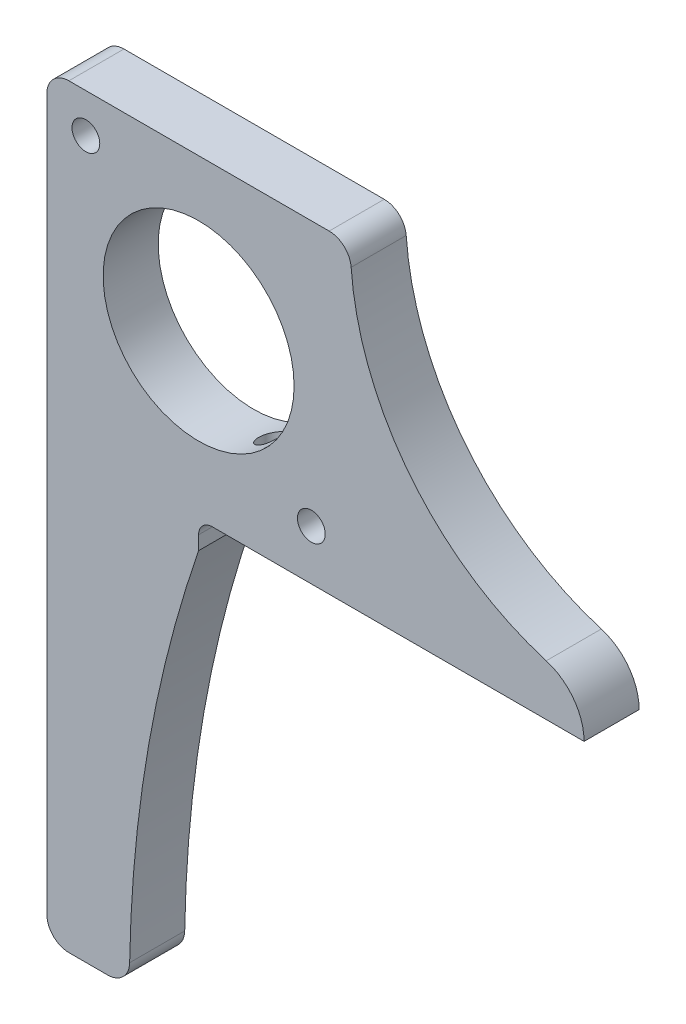
ISO-10303-21;
HEADER;
FILE_DESCRIPTION(('STEP AP214'),'2;1');
FILE_NAME('part.step','',(''),(''),'','','');
FILE_SCHEMA(('AUTOMOTIVE_DESIGN { 1 0 10303 214 1 1 1 1 }'));
ENDSEC;
DATA;
#1=APPLICATION_CONTEXT('core data for automotive mechanical design processes');
#2=APPLICATION_PROTOCOL_DEFINITION('international standard','automotive_design',2000,#1);
#3=PRODUCT_CONTEXT('',#1,'mechanical');
#4=PRODUCT('Part','Part','',(#3));
#5=PRODUCT_RELATED_PRODUCT_CATEGORY('part','',(#4));
#6=PRODUCT_DEFINITION_FORMATION('','',#4);
#7=PRODUCT_DEFINITION_CONTEXT('part definition',#1,'design');
#8=PRODUCT_DEFINITION('design','',#6,#7);
#9=PRODUCT_DEFINITION_SHAPE('','',#8);
#10=(LENGTH_UNIT() NAMED_UNIT(*) SI_UNIT(.MILLI.,.METRE.));
#11=(NAMED_UNIT(*) PLANE_ANGLE_UNIT() SI_UNIT($,.RADIAN.));
#12=(NAMED_UNIT(*) SI_UNIT($,.STERADIAN.) SOLID_ANGLE_UNIT());
#13=UNCERTAINTY_MEASURE_WITH_UNIT(LENGTH_MEASURE(1.E-05),#10,'distance_accuracy_value','');
#14=(GEOMETRIC_REPRESENTATION_CONTEXT(3) GLOBAL_UNCERTAINTY_ASSIGNED_CONTEXT((#13)) GLOBAL_UNIT_ASSIGNED_CONTEXT((#10,
#11,#12)) REPRESENTATION_CONTEXT('',''));
#15=CARTESIAN_POINT('',(0.,0.,0.));
#16=DIRECTION('',(0.,0.,1.));
#17=DIRECTION('',(1.,0.,0.));
#18=AXIS2_PLACEMENT_3D('',#15,#16,#17);
#19=CARTESIAN_POINT('',(66.75,0.,6.35));
#20=DIRECTION('',(0.,0.,1.));
#21=DIRECTION('',(1.,0.,0.));
#22=AXIS2_PLACEMENT_3D('',#19,#20,#21);
#23=PLANE('',#22);
#24=CARTESIAN_POINT('',(30.5,-30.5,6.35));
#25=DIRECTION('',(0.,0.,1.));
#26=DIRECTION('',(1.,0.,0.));
#27=AXIS2_PLACEMENT_3D('',#24,#25,#26);
#28=CIRCLE('',#27,1.6002);
#29=CARTESIAN_POINT('',(32.1002,-30.5,6.35));
#30=VERTEX_POINT('',#29);
#31=EDGE_CURVE('E381',#30,#30,#28,.T.);
#32=ORIENTED_EDGE('',*,*,#31,.F.);
#33=EDGE_LOOP('',(#32));
#34=FACE_BOUND('',#33,.T.);
#35=DIRECTION('',(1.,0.,0.));
#36=VECTOR('',#35,1.);
#37=CARTESIAN_POINT('',(9.525,-87.070000104,6.35));
#38=LINE('',#37,#36);
#39=CARTESIAN_POINT('',(2.54,-87.070000104,6.35));
#40=VERTEX_POINT('',#39);
#41=CARTESIAN_POINT('',(7.00669044993515,-87.070000104,6.35));
#42=VERTEX_POINT('',#41);
#43=EDGE_CURVE('E311',#40,#42,#38,.T.);
#44=ORIENTED_EDGE('',*,*,#43,.T.);
#45=CARTESIAN_POINT('',(7.00669044993515,-84.530000104,6.35));
#46=DIRECTION('',(0.,0.,1.));
#47=DIRECTION('',(1.,0.,0.));
#48=AXIS2_PLACEMENT_3D('',#45,#46,#47);
#49=CIRCLE('',#48,2.54);
#50=CARTESIAN_POINT('',(9.54632002370526,-84.573377840598,6.35));
#51=VERTEX_POINT('',#50);
#52=EDGE_CURVE('E270',#42,#51,#49,.T.);
#53=ORIENTED_EDGE('',*,*,#52,.T.);
#54=CARTESIAN_POINT('',(155.715673981192,-87.070000104,6.35));
#55=DIRECTION('',(0.,0.,-1.));
#56=DIRECTION('',(-1.,0.,0.));
#57=AXIS2_PLACEMENT_3D('',#54,#55,#56);
#58=CIRCLE('',#57,146.190673981192);
#59=CARTESIAN_POINT('',(17.5,-39.445000104,6.35));
#60=VERTEX_POINT('',#59);
#61=EDGE_CURVE('E345',#51,#60,#58,.T.);
#62=ORIENTED_EDGE('',*,*,#61,.T.);
#63=DIRECTION('',(0.,1.,0.));
#64=VECTOR('',#63,1.);
#65=CARTESIAN_POINT('',(17.5,-36.270000104,6.35));
#66=LINE('',#65,#64);
#67=CARTESIAN_POINT('',(17.5,-37.857500104,6.35));
#68=VERTEX_POINT('',#67);
#69=EDGE_CURVE('E366',#60,#68,#66,.T.);
#70=ORIENTED_EDGE('',*,*,#69,.T.);
#71=CARTESIAN_POINT('',(19.0875,-37.857500104,6.35));
#72=DIRECTION('',(0.,0.,1.));
#73=DIRECTION('',(1.,0.,0.));
#74=AXIS2_PLACEMENT_3D('',#71,#72,#73);
#75=CIRCLE('',#74,1.5875);
#76=CARTESIAN_POINT('',(19.0875,-36.270000104,6.35));
#77=VERTEX_POINT('',#76);
#78=EDGE_CURVE('E11',#68,#77,#75,.F.);
#79=ORIENTED_EDGE('',*,*,#78,.T.);
#80=DIRECTION('',(1.,0.,0.));
#81=VECTOR('',#80,1.);
#82=CARTESIAN_POINT('',(17.5,-36.270000104,6.35));
#83=LINE('',#82,#81);
#84=CARTESIAN_POINT('',(61.95,-36.270000104,6.35));
#85=VERTEX_POINT('',#84);
#86=EDGE_CURVE('E363',#77,#85,#83,.T.);
#87=ORIENTED_EDGE('',*,*,#86,.T.);
#88=CARTESIAN_POINT('',(55.8184525502011,-36.270000104,6.35));
#89=DIRECTION('',(0.,0.,1.));
#90=DIRECTION('',(1.,0.,0.));
#91=AXIS2_PLACEMENT_3D('',#88,#89,#90);
#92=CIRCLE('',#91,6.13154744979888);
#93=CARTESIAN_POINT('',(57.5878444151188,-30.3992994169015,6.35));
#94=VERTEX_POINT('',#93);
#95=EDGE_CURVE('E296',#85,#94,#92,.T.);
#96=ORIENTED_EDGE('',*,*,#95,.T.);
#97=CARTESIAN_POINT('',(66.75,0.,6.35));
#98=DIRECTION('',(0.,0.,-1.));
#99=DIRECTION('',(1.,0.,0.));
#100=AXIS2_PLACEMENT_3D('',#97,#98,#99);
#101=CIRCLE('',#100,31.75);
#102=CARTESIAN_POINT('',(35.0872254395332,-2.35185185185185,6.35));
#103=VERTEX_POINT('',#102);
#104=EDGE_CURVE('E288',#94,#103,#101,.T.);
#105=ORIENTED_EDGE('',*,*,#104,.T.);
#106=CARTESIAN_POINT('',(32.5542034746959,-2.54,6.35));
#107=DIRECTION('',(0.,0.,1.));
#108=DIRECTION('',(1.,0.,0.));
#109=AXIS2_PLACEMENT_3D('',#106,#107,#108);
#110=CIRCLE('',#109,2.54);
#111=CARTESIAN_POINT('',(32.5542034746959,0.,6.35));
#112=VERTEX_POINT('',#111);
#113=EDGE_CURVE('E268',#103,#112,#110,.T.);
#114=ORIENTED_EDGE('',*,*,#113,.T.);
#115=DIRECTION('',(-1.,0.,0.));
#116=VECTOR('',#115,1.);
#117=CARTESIAN_POINT('',(0.,0.,6.35));
#118=LINE('',#117,#116);
#119=CARTESIAN_POINT('',(2.54,0.,6.35));
#120=VERTEX_POINT('',#119);
#121=EDGE_CURVE('E298',#112,#120,#118,.T.);
#122=ORIENTED_EDGE('',*,*,#121,.T.);
#123=CARTESIAN_POINT('',(2.54,-2.54,6.35));
#124=DIRECTION('',(0.,0.,1.));
#125=DIRECTION('',(1.,0.,0.));
#126=AXIS2_PLACEMENT_3D('',#123,#124,#125);
#127=CIRCLE('',#126,2.54);
#128=CARTESIAN_POINT('',(0.,-2.54,6.35));
#129=VERTEX_POINT('',#128);
#130=EDGE_CURVE('E260',#120,#129,#127,.T.);
#131=ORIENTED_EDGE('',*,*,#130,.T.);
#132=DIRECTION('',(0.,-1.,0.));
#133=VECTOR('',#132,1.);
#134=CARTESIAN_POINT('',(0.,-36.270000104,6.35));
#135=LINE('',#134,#133);
#136=CARTESIAN_POINT('',(0.,-84.530000104,6.35));
#137=VERTEX_POINT('',#136);
#138=EDGE_CURVE('E309',#129,#137,#135,.T.);
#139=ORIENTED_EDGE('',*,*,#138,.T.);
#140=CARTESIAN_POINT('',(2.54,-84.530000104,6.35));
#141=DIRECTION('',(0.,0.,1.));
#142=DIRECTION('',(1.,0.,0.));
#143=AXIS2_PLACEMENT_3D('',#140,#141,#142);
#144=CIRCLE('',#143,2.54);
#145=EDGE_CURVE('E267',#137,#40,#144,.T.);
#146=ORIENTED_EDGE('',*,*,#145,.T.);
#147=EDGE_LOOP('',(#44,#53,#62,#70,#79,#87,#96,#105,#114,#122,#131,#139,#146));
#148=FACE_BOUND('',#147,.T.);
#149=CARTESIAN_POINT('',(4.5,-4.5,6.35));
#150=DIRECTION('',(0.,0.,1.));
#151=DIRECTION('',(1.,0.,0.));
#152=AXIS2_PLACEMENT_3D('',#149,#150,#151);
#153=CIRCLE('',#152,1.6002);
#154=CARTESIAN_POINT('',(6.1002,-4.5,6.35));
#155=VERTEX_POINT('',#154);
#156=EDGE_CURVE('E373',#155,#155,#153,.T.);
#157=ORIENTED_EDGE('',*,*,#156,.F.);
#158=EDGE_LOOP('',(#157));
#159=FACE_BOUND('',#158,.T.);
#160=CARTESIAN_POINT('',(17.5,-17.5,6.35));
#161=DIRECTION('',(0.,0.,1.));
#162=DIRECTION('',(1.,0.,0.));
#163=AXIS2_PLACEMENT_3D('',#160,#161,#162);
#164=CIRCLE('',#163,11.0109);
#165=CARTESIAN_POINT('',(28.5109,-17.5,6.35));
#166=VERTEX_POINT('',#165);
#167=EDGE_CURVE('E387',#166,#166,#164,.T.);
#168=ORIENTED_EDGE('',*,*,#167,.F.);
#169=EDGE_LOOP('',(#168));
#170=FACE_BOUND('',#169,.T.);
#171=ADVANCED_FACE('F43',(#34,#148,#159,#170),#23,.T.);
#172=CARTESIAN_POINT('',(66.75,0.,0.));
#173=DIRECTION('',(0.,0.,1.));
#174=DIRECTION('',(1.,0.,0.));
#175=AXIS2_PLACEMENT_3D('',#172,#173,#174);
#176=PLANE('',#175);
#177=CARTESIAN_POINT('',(30.5,-30.5,0.));
#178=DIRECTION('',(0.,0.,1.));
#179=DIRECTION('',(1.,0.,0.));
#180=AXIS2_PLACEMENT_3D('',#177,#178,#179);
#181=CIRCLE('',#180,1.6002);
#182=CARTESIAN_POINT('',(32.1002,-30.5,0.));
#183=VERTEX_POINT('',#182);
#184=EDGE_CURVE('E384',#183,#183,#181,.T.);
#185=ORIENTED_EDGE('',*,*,#184,.T.);
#186=EDGE_LOOP('',(#185));
#187=FACE_BOUND('',#186,.T.);
#188=CARTESIAN_POINT('',(155.715673981192,-87.070000104,0.));
#189=DIRECTION('',(0.,0.,-1.));
#190=DIRECTION('',(-1.,0.,0.));
#191=AXIS2_PLACEMENT_3D('',#188,#189,#190);
#192=CIRCLE('',#191,146.190673981192);
#193=CARTESIAN_POINT('',(9.54632002370526,-84.573377840598,0.));
#194=VERTEX_POINT('',#193);
#195=CARTESIAN_POINT('',(17.5,-39.445000104,0.));
#196=VERTEX_POINT('',#195);
#197=EDGE_CURVE('E349',#194,#196,#192,.T.);
#198=ORIENTED_EDGE('',*,*,#197,.F.);
#199=CARTESIAN_POINT('',(7.00669044993515,-84.530000104,0.));
#200=DIRECTION('',(0.,0.,1.));
#201=DIRECTION('',(1.,0.,0.));
#202=AXIS2_PLACEMENT_3D('',#199,#200,#201);
#203=CIRCLE('',#202,2.54);
#204=CARTESIAN_POINT('',(7.00669044993515,-87.070000104,0.));
#205=VERTEX_POINT('',#204);
#206=EDGE_CURVE('E332',#194,#205,#203,.F.);
#207=ORIENTED_EDGE('',*,*,#206,.T.);
#208=DIRECTION('',(1.,0.,0.));
#209=VECTOR('',#208,1.);
#210=CARTESIAN_POINT('',(9.525,-87.070000104,0.));
#211=LINE('',#210,#209);
#212=CARTESIAN_POINT('',(2.54,-87.070000104,0.));
#213=VERTEX_POINT('',#212);
#214=EDGE_CURVE('E341',#213,#205,#211,.T.);
#215=ORIENTED_EDGE('',*,*,#214,.F.);
#216=CARTESIAN_POINT('',(2.54,-84.530000104,0.));
#217=DIRECTION('',(0.,0.,1.));
#218=DIRECTION('',(1.,0.,0.));
#219=AXIS2_PLACEMENT_3D('',#216,#217,#218);
#220=CIRCLE('',#219,2.54);
#221=CARTESIAN_POINT('',(0.,-84.530000104,0.));
#222=VERTEX_POINT('',#221);
#223=EDGE_CURVE('E330',#213,#222,#220,.F.);
#224=ORIENTED_EDGE('',*,*,#223,.T.);
#225=DIRECTION('',(0.,-1.,0.));
#226=VECTOR('',#225,1.);
#227=CARTESIAN_POINT('',(0.,-87.070000104,0.));
#228=LINE('',#227,#226);
#229=CARTESIAN_POINT('',(0.,-2.54,0.));
#230=VERTEX_POINT('',#229);
#231=EDGE_CURVE('E354',#230,#222,#228,.T.);
#232=ORIENTED_EDGE('',*,*,#231,.F.);
#233=CARTESIAN_POINT('',(2.54,-2.54,0.));
#234=DIRECTION('',(0.,0.,1.));
#235=DIRECTION('',(1.,0.,0.));
#236=AXIS2_PLACEMENT_3D('',#233,#234,#235);
#237=CIRCLE('',#236,2.54);
#238=CARTESIAN_POINT('',(2.54,0.,0.));
#239=VERTEX_POINT('',#238);
#240=EDGE_CURVE('E308',#230,#239,#237,.F.);
#241=ORIENTED_EDGE('',*,*,#240,.T.);
#242=DIRECTION('',(-1.,0.,0.));
#243=VECTOR('',#242,1.);
#244=CARTESIAN_POINT('',(0.,0.,0.));
#245=LINE('',#244,#243);
#246=CARTESIAN_POINT('',(32.5542034746959,0.,0.));
#247=VERTEX_POINT('',#246);
#248=EDGE_CURVE('E304',#247,#239,#245,.T.);
#249=ORIENTED_EDGE('',*,*,#248,.F.);
#250=CARTESIAN_POINT('',(32.5542034746959,-2.54,0.));
#251=DIRECTION('',(0.,0.,1.));
#252=DIRECTION('',(1.,0.,0.));
#253=AXIS2_PLACEMENT_3D('',#250,#251,#252);
#254=CIRCLE('',#253,2.54);
#255=CARTESIAN_POINT('',(35.0872254395332,-2.35185185185185,0.));
#256=VERTEX_POINT('',#255);
#257=EDGE_CURVE('E301',#247,#256,#254,.F.);
#258=ORIENTED_EDGE('',*,*,#257,.T.);
#259=CARTESIAN_POINT('',(66.75,0.,0.));
#260=DIRECTION('',(0.,0.,-1.));
#261=DIRECTION('',(1.,0.,0.));
#262=AXIS2_PLACEMENT_3D('',#259,#260,#261);
#263=CIRCLE('',#262,31.75);
#264=CARTESIAN_POINT('',(57.5878444151188,-30.3992994169015,0.));
#265=VERTEX_POINT('',#264);
#266=EDGE_CURVE('E290',#265,#256,#263,.T.);
#267=ORIENTED_EDGE('',*,*,#266,.F.);
#268=CARTESIAN_POINT('',(55.8184525502011,-36.270000104,0.));
#269=DIRECTION('',(0.,0.,1.));
#270=DIRECTION('',(1.,0.,0.));
#271=AXIS2_PLACEMENT_3D('',#268,#269,#270);
#272=CIRCLE('',#271,6.13154744979888);
#273=CARTESIAN_POINT('',(61.95,-36.270000104,0.));
#274=VERTEX_POINT('',#273);
#275=EDGE_CURVE('E313',#274,#265,#272,.T.);
#276=ORIENTED_EDGE('',*,*,#275,.F.);
#277=DIRECTION('',(1.,0.,0.));
#278=VECTOR('',#277,1.);
#279=CARTESIAN_POINT('',(17.5,-36.270000104,0.));
#280=LINE('',#279,#278);
#281=CARTESIAN_POINT('',(19.0875,-36.270000104,0.));
#282=VERTEX_POINT('',#281);
#283=EDGE_CURVE('E352',#282,#274,#280,.T.);
#284=ORIENTED_EDGE('',*,*,#283,.F.);
#285=CARTESIAN_POINT('',(19.0875,-37.857500104,0.));
#286=DIRECTION('',(0.,0.,1.));
#287=DIRECTION('',(1.,0.,0.));
#288=AXIS2_PLACEMENT_3D('',#285,#286,#287);
#289=CIRCLE('',#288,1.5875);
#290=CARTESIAN_POINT('',(17.5,-37.857500104,0.));
#291=VERTEX_POINT('',#290);
#292=EDGE_CURVE('E51',#282,#291,#289,.T.);
#293=ORIENTED_EDGE('',*,*,#292,.T.);
#294=DIRECTION('',(0.,1.,0.));
#295=VECTOR('',#294,1.);
#296=CARTESIAN_POINT('',(17.5,-36.270000104,0.));
#297=LINE('',#296,#295);
#298=EDGE_CURVE('E350',#196,#291,#297,.T.);
#299=ORIENTED_EDGE('',*,*,#298,.F.);
#300=EDGE_LOOP('',(#198,#207,#215,#224,#232,#241,#249,#258,#267,#276,#284,#293,#299));
#301=FACE_BOUND('',#300,.T.);
#302=CARTESIAN_POINT('',(4.5,-4.5,0.));
#303=DIRECTION('',(0.,0.,1.));
#304=DIRECTION('',(1.,0.,0.));
#305=AXIS2_PLACEMENT_3D('',#302,#303,#304);
#306=CIRCLE('',#305,1.6002);
#307=CARTESIAN_POINT('',(6.1002,-4.5,0.));
#308=VERTEX_POINT('',#307);
#309=EDGE_CURVE('E376',#308,#308,#306,.T.);
#310=ORIENTED_EDGE('',*,*,#309,.T.);
#311=EDGE_LOOP('',(#310));
#312=FACE_BOUND('',#311,.T.);
#313=CARTESIAN_POINT('',(17.5,-17.5,0.));
#314=DIRECTION('',(0.,0.,1.));
#315=DIRECTION('',(1.,0.,0.));
#316=AXIS2_PLACEMENT_3D('',#313,#314,#315);
#317=CIRCLE('',#316,11.0109);
#318=CARTESIAN_POINT('',(28.5109,-17.5,0.));
#319=VERTEX_POINT('',#318);
#320=EDGE_CURVE('E390',#319,#319,#317,.T.);
#321=ORIENTED_EDGE('',*,*,#320,.T.);
#322=EDGE_LOOP('',(#321));
#323=FACE_BOUND('',#322,.T.);
#324=ADVANCED_FACE('F203',(#187,#301,#312,#323),#176,.F.);
#325=CARTESIAN_POINT('',(0.,-87.070000104,6.35));
#326=DIRECTION('',(1.,0.,0.));
#327=DIRECTION('',(0.,0.,-1.));
#328=AXIS2_PLACEMENT_3D('',#325,#326,#327);
#329=PLANE('',#328);
#330=ORIENTED_EDGE('',*,*,#231,.T.);
#331=DIRECTION('',(0.,0.,-1.));
#332=VECTOR('',#331,1.);
#333=CARTESIAN_POINT('',(0.,-84.530000104,6.35));
#334=LINE('',#333,#332);
#335=EDGE_CURVE('E278',#222,#137,#334,.F.);
#336=ORIENTED_EDGE('',*,*,#335,.T.);
#337=ORIENTED_EDGE('',*,*,#138,.F.);
#338=DIRECTION('',(0.,0.,-1.));
#339=VECTOR('',#338,1.);
#340=CARTESIAN_POINT('',(0.,-2.54,6.35));
#341=LINE('',#340,#339);
#342=EDGE_CURVE('E263',#129,#230,#341,.T.);
#343=ORIENTED_EDGE('',*,*,#342,.T.);
#344=EDGE_LOOP('',(#330,#336,#337,#343));
#345=FACE_BOUND('',#344,.T.);
#346=ADVANCED_FACE('F208',(#345),#329,.F.);
#347=CARTESIAN_POINT('',(9.525,-87.070000104,6.35));
#348=DIRECTION('',(0.,1.,0.));
#349=DIRECTION('',(0.,0.,1.));
#350=AXIS2_PLACEMENT_3D('',#347,#348,#349);
#351=PLANE('',#350);
#352=ORIENTED_EDGE('',*,*,#214,.T.);
#353=DIRECTION('',(0.,0.,-1.));
#354=VECTOR('',#353,1.);
#355=CARTESIAN_POINT('',(7.00669044993515,-87.070000104,6.35));
#356=LINE('',#355,#354);
#357=EDGE_CURVE('E272',#205,#42,#356,.F.);
#358=ORIENTED_EDGE('',*,*,#357,.T.);
#359=ORIENTED_EDGE('',*,*,#43,.F.);
#360=DIRECTION('',(0.,0.,-1.));
#361=VECTOR('',#360,1.);
#362=CARTESIAN_POINT('',(2.54,-87.070000104,6.35));
#363=LINE('',#362,#361);
#364=EDGE_CURVE('E334',#40,#213,#363,.T.);
#365=ORIENTED_EDGE('',*,*,#364,.T.);
#366=EDGE_LOOP('',(#352,#358,#359,#365));
#367=FACE_BOUND('',#366,.T.);
#368=ADVANCED_FACE('F238',(#367),#351,.F.);
#369=CARTESIAN_POINT('',(155.715673981192,-87.070000104,6.35));
#370=DIRECTION('',(0.,0.,-1.));
#371=DIRECTION('',(-1.,0.,0.));
#372=AXIS2_PLACEMENT_3D('',#369,#370,#371);
#373=CYLINDRICAL_SURFACE('',#372,146.190673981192);
#374=ORIENTED_EDGE('',*,*,#61,.F.);
#375=DIRECTION('',(0.,0.,-1.));
#376=VECTOR('',#375,1.);
#377=CARTESIAN_POINT('',(9.5463200237052,-84.573377840598,6.35));
#378=LINE('',#377,#376);
#379=EDGE_CURVE('E325',#51,#194,#378,.T.);
#380=ORIENTED_EDGE('',*,*,#379,.T.);
#381=ORIENTED_EDGE('',*,*,#197,.T.);
#382=DIRECTION('',(0.,0.,-1.));
#383=VECTOR('',#382,1.);
#384=CARTESIAN_POINT('',(17.5,-39.445000104,6.35));
#385=LINE('',#384,#383);
#386=EDGE_CURVE('E322',#60,#196,#385,.T.);
#387=ORIENTED_EDGE('',*,*,#386,.F.);
#388=EDGE_LOOP('',(#374,#380,#381,#387));
#389=FACE_BOUND('',#388,.T.);
#390=ADVANCED_FACE('F235',(#389),#373,.F.);
#391=CARTESIAN_POINT('',(17.5,-36.270000104,6.35));
#392=DIRECTION('',(-1.,0.,0.));
#393=DIRECTION('',(0.,0.,1.));
#394=AXIS2_PLACEMENT_3D('',#391,#392,#393);
#395=PLANE('',#394);
#396=ORIENTED_EDGE('',*,*,#298,.T.);
#397=DIRECTION('',(0.,0.,-1.));
#398=VECTOR('',#397,1.);
#399=CARTESIAN_POINT('',(17.5,-37.857500104,6.35));
#400=LINE('',#399,#398);
#401=EDGE_CURVE('E58',#291,#68,#400,.F.);
#402=ORIENTED_EDGE('',*,*,#401,.T.);
#403=ORIENTED_EDGE('',*,*,#69,.F.);
#404=ORIENTED_EDGE('',*,*,#386,.T.);
#405=EDGE_LOOP('',(#396,#402,#403,#404));
#406=FACE_BOUND('',#405,.T.);
#407=ADVANCED_FACE('F231',(#406),#395,.F.);
#408=CARTESIAN_POINT('',(17.5,-36.270000104,6.35));
#409=DIRECTION('',(0.,1.,0.));
#410=DIRECTION('',(0.,0.,1.));
#411=AXIS2_PLACEMENT_3D('',#408,#409,#410);
#412=PLANE('',#411);
#413=CARTESIAN_POINT('',(22.58,-36.270000104,3.175));
#414=DIRECTION('',(0.,-1.,0.));
#415=DIRECTION('',(0.,0.,-1.));
#416=AXIS2_PLACEMENT_3D('',#413,#414,#415);
#417=CIRCLE('',#416,1.35255);
#418=CARTESIAN_POINT('',(22.58,-36.270000104,1.82245));
#419=VERTEX_POINT('',#418);
#420=EDGE_CURVE('E160',#419,#419,#417,.T.);
#421=ORIENTED_EDGE('',*,*,#420,.F.);
#422=EDGE_LOOP('',(#421));
#423=FACE_BOUND('',#422,.T.);
#424=CARTESIAN_POINT('',(47.98,-36.270000104,3.175));
#425=DIRECTION('',(0.,-1.,0.));
#426=DIRECTION('',(0.,0.,-1.));
#427=AXIS2_PLACEMENT_3D('',#424,#425,#426);
#428=CIRCLE('',#427,1.35255);
#429=CARTESIAN_POINT('',(47.98,-36.270000104,1.82245));
#430=VERTEX_POINT('',#429);
#431=EDGE_CURVE('E159',#430,#430,#428,.T.);
#432=ORIENTED_EDGE('',*,*,#431,.F.);
#433=EDGE_LOOP('',(#432));
#434=FACE_BOUND('',#433,.T.);
#435=ORIENTED_EDGE('',*,*,#86,.F.);
#436=DIRECTION('',(0.,0.,-1.));
#437=VECTOR('',#436,1.);
#438=CARTESIAN_POINT('',(19.0875,-36.270000104,0.));
#439=LINE('',#438,#437);
#440=EDGE_CURVE('E164',#77,#282,#439,.T.);
#441=ORIENTED_EDGE('',*,*,#440,.T.);
#442=ORIENTED_EDGE('',*,*,#283,.T.);
#443=DIRECTION('',(0.,0.,-1.));
#444=VECTOR('',#443,1.);
#445=CARTESIAN_POINT('',(61.95,-36.270000104,6.35));
#446=LINE('',#445,#444);
#447=EDGE_CURVE('E319',#85,#274,#446,.T.);
#448=ORIENTED_EDGE('',*,*,#447,.F.);
#449=EDGE_LOOP('',(#435,#441,#442,#448));
#450=FACE_BOUND('',#449,.T.);
#451=ADVANCED_FACE('F227',(#423,#434,#450),#412,.F.);
#452=CARTESIAN_POINT('',(55.8184525502011,-36.270000104,6.35));
#453=DIRECTION('',(0.,0.,-1.));
#454=DIRECTION('',(-1.,0.,0.));
#455=AXIS2_PLACEMENT_3D('',#452,#453,#454);
#456=CYLINDRICAL_SURFACE('',#455,6.13154744979888);
#457=ORIENTED_EDGE('',*,*,#275,.T.);
#458=DIRECTION('',(0.,0.,-1.));
#459=VECTOR('',#458,1.);
#460=CARTESIAN_POINT('',(57.5878444151188,-30.3992994169015,6.35));
#461=LINE('',#460,#459);
#462=EDGE_CURVE('E317',#94,#265,#461,.T.);
#463=ORIENTED_EDGE('',*,*,#462,.F.);
#464=ORIENTED_EDGE('',*,*,#95,.F.);
#465=ORIENTED_EDGE('',*,*,#447,.T.);
#466=EDGE_LOOP('',(#457,#463,#464,#465));
#467=FACE_BOUND('',#466,.T.);
#468=ADVANCED_FACE('F223',(#467),#456,.T.);
#469=CARTESIAN_POINT('',(66.75,0.,6.35));
#470=DIRECTION('',(0.,0.,-1.));
#471=DIRECTION('',(-1.,0.,0.));
#472=AXIS2_PLACEMENT_3D('',#469,#470,#471);
#473=CYLINDRICAL_SURFACE('',#472,31.75);
#474=ORIENTED_EDGE('',*,*,#266,.T.);
#475=DIRECTION('',(0.,0.,-1.));
#476=VECTOR('',#475,1.);
#477=CARTESIAN_POINT('',(35.0872254395332,-2.35185185185185,6.35));
#478=LINE('',#477,#476);
#479=EDGE_CURVE('E154',#256,#103,#478,.F.);
#480=ORIENTED_EDGE('',*,*,#479,.T.);
#481=ORIENTED_EDGE('',*,*,#104,.F.);
#482=ORIENTED_EDGE('',*,*,#462,.T.);
#483=EDGE_LOOP('',(#474,#480,#481,#482));
#484=FACE_BOUND('',#483,.T.);
#485=ADVANCED_FACE('F219',(#484),#473,.F.);
#486=CARTESIAN_POINT('',(0.,0.,6.35));
#487=DIRECTION('',(0.,-1.,0.));
#488=DIRECTION('',(0.,0.,-1.));
#489=AXIS2_PLACEMENT_3D('',#486,#487,#488);
#490=PLANE('',#489);
#491=ORIENTED_EDGE('',*,*,#248,.T.);
#492=DIRECTION('',(0.,0.,-1.));
#493=VECTOR('',#492,1.);
#494=CARTESIAN_POINT('',(2.54,0.,6.35));
#495=LINE('',#494,#493);
#496=EDGE_CURVE('E261',#239,#120,#495,.F.);
#497=ORIENTED_EDGE('',*,*,#496,.T.);
#498=ORIENTED_EDGE('',*,*,#121,.F.);
#499=DIRECTION('',(0.,0.,-1.));
#500=VECTOR('',#499,1.);
#501=CARTESIAN_POINT('',(32.5542034746959,0.,6.35));
#502=LINE('',#501,#500);
#503=EDGE_CURVE('E280',#112,#247,#502,.T.);
#504=ORIENTED_EDGE('',*,*,#503,.T.);
#505=EDGE_LOOP('',(#491,#497,#498,#504));
#506=FACE_BOUND('',#505,.T.);
#507=ADVANCED_FACE('F216',(#506),#490,.F.);
#508=CARTESIAN_POINT('',(4.5,-4.5,6.35));
#509=DIRECTION('',(0.,0.,-1.));
#510=DIRECTION('',(-1.,0.,0.));
#511=AXIS2_PLACEMENT_3D('',#508,#509,#510);
#512=CYLINDRICAL_SURFACE('',#511,1.6002);
#513=ORIENTED_EDGE('',*,*,#156,.T.);
#514=EDGE_LOOP('',(#513));
#515=FACE_BOUND('',#514,.T.);
#516=ORIENTED_EDGE('',*,*,#309,.F.);
#517=EDGE_LOOP('',(#516));
#518=FACE_BOUND('',#517,.T.);
#519=ADVANCED_FACE('F214',(#515,#518),#512,.F.);
#520=CARTESIAN_POINT('',(30.5,-30.5,6.35));
#521=DIRECTION('',(0.,0.,-1.));
#522=DIRECTION('',(-1.,0.,0.));
#523=AXIS2_PLACEMENT_3D('',#520,#521,#522);
#524=CYLINDRICAL_SURFACE('',#523,1.6002);
#525=ORIENTED_EDGE('',*,*,#31,.T.);
#526=EDGE_LOOP('',(#525));
#527=FACE_BOUND('',#526,.T.);
#528=ORIENTED_EDGE('',*,*,#184,.F.);
#529=EDGE_LOOP('',(#528));
#530=FACE_BOUND('',#529,.T.);
#531=ADVANCED_FACE('F410',(#527,#530),#524,.F.);
#532=CARTESIAN_POINT('',(17.5,-17.5,6.35));
#533=DIRECTION('',(0.,0.,-1.));
#534=DIRECTION('',(-1.,0.,0.));
#535=AXIS2_PLACEMENT_3D('',#532,#533,#534);
#536=CYLINDRICAL_SURFACE('',#535,11.0109);
#537=CARTESIAN_POINT('',(23.2632447972397,-26.882160104,2.00770909814869));
#538=CARTESIAN_POINT('',(23.2191274192163,-26.9092627305194,1.98190065627333));
#539=CARTESIAN_POINT('',(23.1737607937613,-26.9366984105925,1.95869106276661));
#540=CARTESIAN_POINT('',(23.0808740764004,-26.9919272441979,1.91757885540883));
#541=CARTESIAN_POINT('',(23.0333535034497,-27.0197204765804,1.89967743384087));
#542=CARTESIAN_POINT('',(22.8880963102266,-27.1031622289968,1.8541110158982));
#543=CARTESIAN_POINT('',(22.7876762564426,-27.1588653553026,1.83459086021908));
#544=CARTESIAN_POINT('',(22.5991203161401,-27.2595385986938,1.81979061450837));
#545=CARTESIAN_POINT('',(22.5114027069368,-27.3048648604502,1.8213122236522));
#546=CARTESIAN_POINT('',(22.3364415800379,-27.392333880953,1.84165876886262));
#547=CARTESIAN_POINT('',(22.2491975568835,-27.4344811946954,1.8604584178442));
#548=CARTESIAN_POINT('',(22.0828068769375,-27.5122827250559,1.91427245749288));
#549=CARTESIAN_POINT('',(22.0034754197801,-27.5481613547704,1.94838644078591));
#550=CARTESIAN_POINT('',(21.8512342705955,-27.6150177486546,2.03227119667013));
#551=CARTESIAN_POINT('',(21.7783218616213,-27.6459975907646,2.0820353039625));
#552=CARTESIAN_POINT('',(21.6492213853346,-27.6994254778065,2.19040894968857));
#553=CARTESIAN_POINT('',(21.5920888051906,-27.7224182316324,2.24762552161462));
#554=CARTESIAN_POINT('',(21.4882901062074,-27.7633610285751,2.37242009969434));
#555=CARTESIAN_POINT('',(21.4416174827113,-27.7813142073797,2.43999162221827));
#556=CARTESIAN_POINT('',(21.3643647403757,-27.8105853790684,2.57726146314473));
#557=CARTESIAN_POINT('',(21.3327520134929,-27.8223385097762,2.64628752910649));
#558=CARTESIAN_POINT('',(21.2814151795915,-27.8412558825341,2.78921734625611));
#559=CARTESIAN_POINT('',(21.261687295199,-27.848421582658,2.86311953936428));
#560=CARTESIAN_POINT('',(21.2356068211506,-27.8578638549165,3.00983045964442));
#561=CARTESIAN_POINT('',(21.2286525812627,-27.86036045762,3.08251872595468));
#562=CARTESIAN_POINT('',(21.2265343148407,-27.8611226842052,3.22808478156545));
#563=CARTESIAN_POINT('',(21.2313686524239,-27.8593888951319,3.30096254316808));
#564=CARTESIAN_POINT('',(21.2524632656462,-27.8517659546779,3.443615354599));
#565=CARTESIAN_POINT('',(21.2685391523779,-27.8459438552294,3.51342141342629));
#566=CARTESIAN_POINT('',(21.3113081878209,-27.8302644419951,3.64921519793276));
#567=CARTESIAN_POINT('',(21.3380012837232,-27.8204071482801,3.71520294260199));
#568=CARTESIAN_POINT('',(21.4013614909001,-27.7966231685822,3.84230772595344));
#569=CARTESIAN_POINT('',(21.4381328576693,-27.7826538267068,3.90336469883516));
#570=CARTESIAN_POINT('',(21.5201898713736,-27.7508498827576,4.0183169499585));
#571=CARTESIAN_POINT('',(21.5654765378499,-27.7330148177997,4.0722113693038));
#572=CARTESIAN_POINT('',(21.6648885932006,-27.6929678631149,4.17359512341496));
#573=CARTESIAN_POINT('',(21.7192845599078,-27.6706153517114,4.22076304616354));
#574=CARTESIAN_POINT('',(21.8337836446012,-27.6223563264631,4.30531972276142));
#575=CARTESIAN_POINT('',(21.8938882454652,-27.5964488884072,4.34270592618467));
#576=CARTESIAN_POINT('',(22.0222118662112,-27.5396593225933,4.40943921206858));
#577=CARTESIAN_POINT('',(22.0907047577537,-27.508559404209,4.43807295987646));
#578=CARTESIAN_POINT('',(22.2301400301379,-27.4434211412268,4.48357719981378));
#579=CARTESIAN_POINT('',(22.3010832152698,-27.4093818261873,4.50044379020204));
#580=CARTESIAN_POINT('',(22.4501423579769,-27.3358283652304,4.52360044676788));
#581=CARTESIAN_POINT('',(22.5283228021518,-27.2960979844918,4.52878658392732));
#582=CARTESIAN_POINT('',(22.6835258856988,-27.214868717428,4.52581648062969));
#583=CARTESIAN_POINT('',(22.7605477890849,-27.1733687662278,4.5176520926385));
#584=CARTESIAN_POINT('',(22.9112084302784,-27.0898940752176,4.48859936143994));
#585=CARTESIAN_POINT('',(22.984865831107,-27.0479241437291,4.46779367402509));
#586=CARTESIAN_POINT('',(23.1277336154652,-26.9644352148196,4.41402787032647));
#587=CARTESIAN_POINT('',(23.196949466236,-26.9229157173977,4.38108304705518));
#588=CARTESIAN_POINT('',(23.2632447972397,-26.882160104,4.34229090185131));
#589=B_SPLINE_CURVE_WITH_KNOTS('',3,(#537,#538,#539,#540,#541,#542,#543,#544,#545,#546,#547,
#548,#549,#550,#551,#552,#553,#554,#555,#556,#557,#558,#559,#560,#561,#562,#563,#564,#565,#566,
#567,#568,#569,#570,#571,#572,#573,#574,#575,#576,#577,#578,#579,#580,#581,#582,#583,#584,#585,
#586,#587,#588),.UNSPECIFIED.,.F.,.F.,(4,2,2,2,2,2,2,2,2,2,2,2,2,2,2,2,2,2,2,2,2,2,2,2,2,4),(0.,
0.173388672671856,0.346816261200677,0.69371801089115,0.988556295232268,1.2829637582112,
1.56195826536474,1.84083411089345,2.0916626561314,2.34233478494944,2.57163963437264,
2.80087156505883,3.01899867868032,3.2370955248612,3.45169648792731,3.66629638360195,
3.88320595752511,4.10014151869694,4.32532466461161,4.55056646503305,4.7910181640755,
5.03154955398475,5.29400090042641,5.55661247498094,5.81752515665135,6.07811025536497),.UNSPECIFIED.);
#590=CARTESIAN_POINT('',(23.2632447972397,-26.882160104,2.00770909814869));
#591=VERTEX_POINT('',#590);
#592=CARTESIAN_POINT('',(23.2632447972397,-26.882160104,4.34229090185131));
#593=VERTEX_POINT('',#592);
#594=EDGE_CURVE('E153',#591,#593,#589,.T.);
#595=ORIENTED_EDGE('',*,*,#594,.F.);
#596=CARTESIAN_POINT('',(23.1284665197313,-26.9636295070266,4.55837946886818));
#597=CARTESIAN_POINT('',(23.1644447250532,-26.9422339802703,4.50578466951955));
#598=CARTESIAN_POINT('',(23.1989302142685,-26.9214435865174,4.45188737227398));
#599=CARTESIAN_POINT('',(23.2645738333159,-26.8814218908448,4.34139390757448));
#600=CARTESIAN_POINT('',(23.2957251950599,-26.8621937786252,4.28479257558234));
#601=CARTESIAN_POINT('',(23.3545472082925,-26.8255248730036,4.16834323990371));
#602=CARTESIAN_POINT('',(23.3821738632433,-26.8081070962662,4.10846545526405));
#603=CARTESIAN_POINT('',(23.4329518152214,-26.7758236087467,3.98624476986327));
#604=CARTESIAN_POINT('',(23.4561065165027,-26.7609559576659,3.92390378809683));
#605=CARTESIAN_POINT('',(23.5086846321019,-26.7269764003074,3.76191963122994));
#606=CARTESIAN_POINT('',(23.5345706548835,-26.7100155637428,3.66058729172442));
#607=CARTESIAN_POINT('',(23.5624697143208,-26.6916536167661,3.50611591296122));
#608=CARTESIAN_POINT('',(23.5699434729749,-26.6867158166936,3.4543234237821));
#609=CARTESIAN_POINT('',(23.5811056043583,-26.6793311603187,3.35016286932158));
#610=CARTESIAN_POINT('',(23.5847956421596,-26.6768832083323,3.29779506747671));
#611=CARTESIAN_POINT('',(23.5882848105402,-26.674568710515,3.19262309877366));
#612=CARTESIAN_POINT('',(23.5880652377701,-26.674714573339,3.13981804294823));
#613=CARTESIAN_POINT('',(23.5836986540673,-26.6776105928072,3.03444408903241));
#614=CARTESIAN_POINT('',(23.5795516323262,-26.6803607566186,2.98187519159234));
#615=CARTESIAN_POINT('',(23.5674406995634,-26.6883695350486,2.87725186117769));
#616=CARTESIAN_POINT('',(23.5594680442014,-26.693633896297,2.82519888705885));
#617=CARTESIAN_POINT('',(23.5399263321297,-26.7064837926289,2.72205304908065));
#618=CARTESIAN_POINT('',(23.5283554706957,-26.7140704924801,2.67096068069229));
#619=CARTESIAN_POINT('',(23.4816414390815,-26.7445384784776,2.49281002888441));
#620=CARTESIAN_POINT('',(23.4375003912939,-26.7730731413051,2.36900047814466));
#621=CARTESIAN_POINT('',(23.332741865084,-26.8393171521085,2.13150467445731));
#622=CARTESIAN_POINT('',(23.2721174465262,-26.8770303639049,2.0178227124433));
#623=CARTESIAN_POINT('',(23.1927430338477,-26.9251158094131,1.8893760974284));
#624=CARTESIAN_POINT('',(23.1801667041231,-26.9327010621735,1.86955440776508));
#625=CARTESIAN_POINT('',(23.1546176198895,-26.9480388486128,1.83030566262131));
#626=CARTESIAN_POINT('',(23.1416458444107,-26.955790957097,1.8108778038551));
#627=CARTESIAN_POINT('',(23.1284665197314,-26.9636295070266,1.79162053113177));
#628=B_SPLINE_CURVE_WITH_KNOTS('',3,(#596,#597,#598,#599,#600,#601,#602,#603,#604,#605,#606,
#607,#608,#609,#610,#611,#612,#613,#614,#615,#616,#617,#618,#619,#620,#621,#622,#623,#624,#625,
#626,#627),.UNSPECIFIED.,.F.,.F.,(4,2,2,2,2,2,2,2,2,2,2,2,2,2,2,4),(0.,0.20166499308406,
0.403731886038485,0.608115257521544,0.812342424505783,1.12869099781776,1.28621231347195,
1.44366428018185,1.60186968945821,1.76007553412596,1.91864472872249,2.07729358427386,
2.47842714457869,2.87972985983663,2.95373797747625,3.02757575842154),.UNSPECIFIED.);
#629=EDGE_CURVE('E146',#593,#591,#628,.T.);
#630=ORIENTED_EDGE('',*,*,#629,.F.);
#631=EDGE_LOOP('',(#595,#630));
#632=FACE_BOUND('',#631,.T.);
#633=ORIENTED_EDGE('',*,*,#167,.T.);
#634=EDGE_LOOP('',(#633));
#635=FACE_BOUND('',#634,.T.);
#636=ORIENTED_EDGE('',*,*,#320,.F.);
#637=EDGE_LOOP('',(#636));
#638=FACE_BOUND('',#637,.T.);
#639=ADVANCED_FACE('F162',(#632,#635,#638),#536,.F.);
#640=CARTESIAN_POINT('',(7.00669044993515,-84.530000104,6.35));
#641=DIRECTION('',(0.,0.,-1.));
#642=DIRECTION('',(-1.,0.,0.));
#643=AXIS2_PLACEMENT_3D('',#640,#641,#642);
#644=CYLINDRICAL_SURFACE('',#643,2.54);
#645=ORIENTED_EDGE('',*,*,#52,.F.);
#646=ORIENTED_EDGE('',*,*,#357,.F.);
#647=ORIENTED_EDGE('',*,*,#206,.F.);
#648=ORIENTED_EDGE('',*,*,#379,.F.);
#649=EDGE_LOOP('',(#645,#646,#647,#648));
#650=FACE_BOUND('',#649,.T.);
#651=ADVANCED_FACE('F246',(#650),#644,.T.);
#652=CARTESIAN_POINT('',(2.54,-84.530000104,6.35));
#653=DIRECTION('',(0.,0.,-1.));
#654=DIRECTION('',(-1.,0.,0.));
#655=AXIS2_PLACEMENT_3D('',#652,#653,#654);
#656=CYLINDRICAL_SURFACE('',#655,2.54);
#657=ORIENTED_EDGE('',*,*,#145,.F.);
#658=ORIENTED_EDGE('',*,*,#335,.F.);
#659=ORIENTED_EDGE('',*,*,#223,.F.);
#660=ORIENTED_EDGE('',*,*,#364,.F.);
#661=EDGE_LOOP('',(#657,#658,#659,#660));
#662=FACE_BOUND('',#661,.T.);
#663=ADVANCED_FACE('F249',(#662),#656,.T.);
#664=CARTESIAN_POINT('',(2.54,-2.54,6.35));
#665=DIRECTION('',(0.,0.,-1.));
#666=DIRECTION('',(-1.,0.,0.));
#667=AXIS2_PLACEMENT_3D('',#664,#665,#666);
#668=CYLINDRICAL_SURFACE('',#667,2.54);
#669=ORIENTED_EDGE('',*,*,#130,.F.);
#670=ORIENTED_EDGE('',*,*,#496,.F.);
#671=ORIENTED_EDGE('',*,*,#240,.F.);
#672=ORIENTED_EDGE('',*,*,#342,.F.);
#673=EDGE_LOOP('',(#669,#670,#671,#672));
#674=FACE_BOUND('',#673,.T.);
#675=ADVANCED_FACE('F199',(#674),#668,.T.);
#676=CARTESIAN_POINT('',(32.5542034746959,-2.54,6.35));
#677=DIRECTION('',(0.,0.,-1.));
#678=DIRECTION('',(-1.,0.,0.));
#679=AXIS2_PLACEMENT_3D('',#676,#677,#678);
#680=CYLINDRICAL_SURFACE('',#679,2.54);
#681=ORIENTED_EDGE('',*,*,#113,.F.);
#682=ORIENTED_EDGE('',*,*,#479,.F.);
#683=ORIENTED_EDGE('',*,*,#257,.F.);
#684=ORIENTED_EDGE('',*,*,#503,.F.);
#685=EDGE_LOOP('',(#681,#682,#683,#684));
#686=FACE_BOUND('',#685,.T.);
#687=ADVANCED_FACE('F192',(#686),#680,.T.);
#688=CARTESIAN_POINT('',(47.98,-26.882160104,3.175));
#689=DIRECTION('',(0.,-1.,0.));
#690=DIRECTION('',(0.,0.,-1.));
#691=AXIS2_PLACEMENT_3D('',#688,#689,#690);
#692=CONICAL_SURFACE('',#691,1.35255,1.02974425867665);
#693=CARTESIAN_POINT('',(47.98,-26.0694660737343,3.175));
#694=VERTEX_POINT('',#693);
#695=VERTEX_LOOP('',#694);
#696=FACE_BOUND('',#695,.T.);
#697=CARTESIAN_POINT('',(47.98,-26.882160104,3.175));
#698=DIRECTION('',(0.,-1.,0.));
#699=DIRECTION('',(0.,0.,-1.));
#700=AXIS2_PLACEMENT_3D('',#697,#698,#699);
#701=CIRCLE('',#700,1.35255);
#702=CARTESIAN_POINT('',(47.98,-26.882160104,1.82245));
#703=VERTEX_POINT('',#702);
#704=EDGE_CURVE('E393',#703,#703,#701,.T.);
#705=ORIENTED_EDGE('',*,*,#704,.T.);
#706=EDGE_LOOP('',(#705));
#707=FACE_BOUND('',#706,.T.);
#708=ADVANCED_FACE('F189',(#696,#707),#692,.F.);
#709=CARTESIAN_POINT('',(47.98,-36.270000104,3.175));
#710=DIRECTION('',(0.,-1.,0.));
#711=DIRECTION('',(0.,0.,-1.));
#712=AXIS2_PLACEMENT_3D('',#709,#710,#711);
#713=CYLINDRICAL_SURFACE('',#712,1.35255);
#714=ORIENTED_EDGE('',*,*,#704,.F.);
#715=EDGE_LOOP('',(#714));
#716=FACE_BOUND('',#715,.T.);
#717=ORIENTED_EDGE('',*,*,#431,.T.);
#718=EDGE_LOOP('',(#717));
#719=FACE_BOUND('',#718,.T.);
#720=ADVANCED_FACE('F187',(#716,#719),#713,.F.);
#721=CARTESIAN_POINT('',(22.58,-26.882160104,3.175));
#722=DIRECTION('',(0.,-1.,0.));
#723=DIRECTION('',(0.,0.,-1.));
#724=AXIS2_PLACEMENT_3D('',#721,#722,#723);
#725=CONICAL_SURFACE('',#724,1.35255,1.02974425867665);
#726=ORIENTED_EDGE('',*,*,#629,.T.);
#727=CARTESIAN_POINT('',(22.58,-26.882160104,3.175));
#728=DIRECTION('',(0.,-1.,0.));
#729=DIRECTION('',(0.,0.,-1.));
#730=AXIS2_PLACEMENT_3D('',#727,#728,#729);
#731=CIRCLE('',#730,1.35255);
#732=EDGE_CURVE('E149',#591,#593,#731,.T.);
#733=ORIENTED_EDGE('',*,*,#732,.T.);
#734=EDGE_LOOP('',(#726,#733));
#735=FACE_BOUND('',#734,.T.);
#736=ADVANCED_FACE('F148',(#735),#725,.F.);
#737=CARTESIAN_POINT('',(22.58,-36.270000104,3.175));
#738=DIRECTION('',(0.,-1.,0.));
#739=DIRECTION('',(0.,0.,-1.));
#740=AXIS2_PLACEMENT_3D('',#737,#738,#739);
#741=CYLINDRICAL_SURFACE('',#740,1.35255);
#742=ORIENTED_EDGE('',*,*,#594,.T.);
#743=ORIENTED_EDGE('',*,*,#732,.F.);
#744=EDGE_LOOP('',(#742,#743));
#745=FACE_BOUND('',#744,.T.);
#746=ORIENTED_EDGE('',*,*,#420,.T.);
#747=EDGE_LOOP('',(#746));
#748=FACE_BOUND('',#747,.T.);
#749=ADVANCED_FACE('F157',(#745,#748),#741,.F.);
#750=CARTESIAN_POINT('',(19.0875,-37.857500104,6.35));
#751=DIRECTION('',(0.,0.,1.));
#752=DIRECTION('',(1.,0.,0.));
#753=AXIS2_PLACEMENT_3D('',#750,#751,#752);
#754=CYLINDRICAL_SURFACE('',#753,1.5875);
#755=ORIENTED_EDGE('',*,*,#78,.F.);
#756=ORIENTED_EDGE('',*,*,#401,.F.);
#757=ORIENTED_EDGE('',*,*,#292,.F.);
#758=ORIENTED_EDGE('',*,*,#440,.F.);
#759=EDGE_LOOP('',(#755,#756,#757,#758));
#760=FACE_BOUND('',#759,.T.);
#761=ADVANCED_FACE('F45',(#760),#754,.F.);
#762=CLOSED_SHELL('',(#171,#324,#346,#368,#390,#407,#451,#468,#485,#507,#519,#531,#639,#651,
#663,#675,#687,#708,#720,#736,#749,#761));
#763=MANIFOLD_SOLID_BREP('B2',#762);
#764=ADVANCED_BREP_SHAPE_REPRESENTATION('',(#18,#763),#14);
#765=SHAPE_DEFINITION_REPRESENTATION(#9,#764);
ENDSEC;
END-ISO-10303-21;
